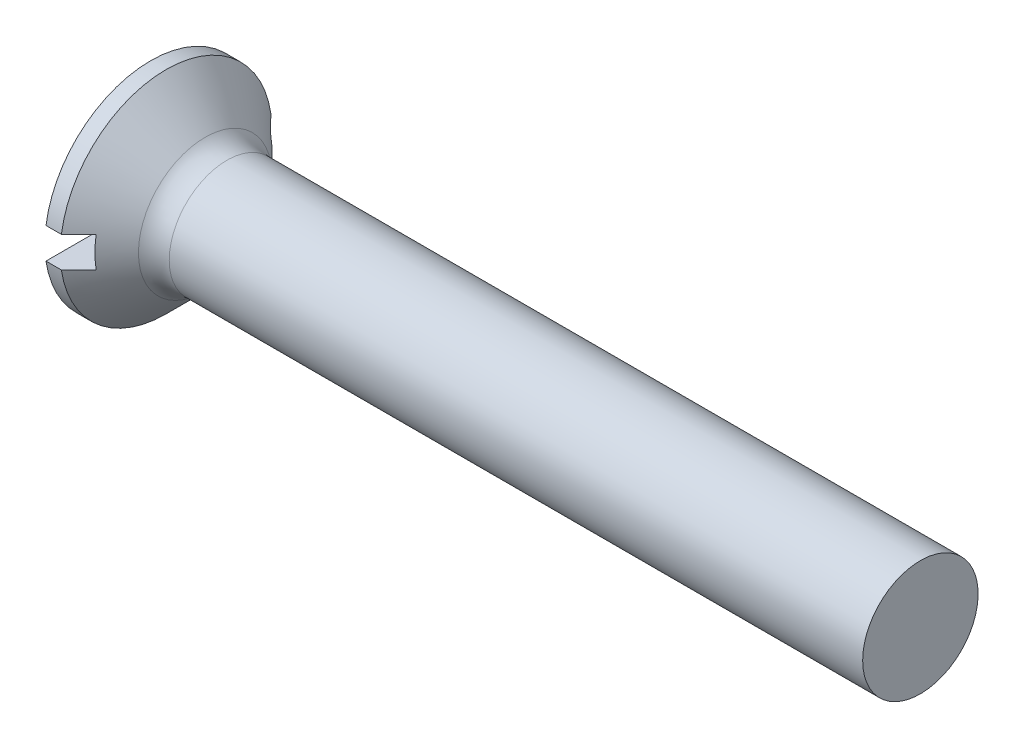
ISO-10303-21;
HEADER;
FILE_DESCRIPTION(('STEP AP214'),'2;1');
FILE_NAME('part.step','',(''),(''),'','','');
FILE_SCHEMA(('AUTOMOTIVE_DESIGN { 1 0 10303 214 1 1 1 1 }'));
ENDSEC;
DATA;
#1=APPLICATION_CONTEXT('core data for automotive mechanical design processes');
#2=APPLICATION_PROTOCOL_DEFINITION('international standard','automotive_design',2000,#1);
#3=PRODUCT_CONTEXT('',#1,'mechanical');
#4=PRODUCT('Part','Part','',(#3));
#5=PRODUCT_RELATED_PRODUCT_CATEGORY('part','',(#4));
#6=PRODUCT_DEFINITION_FORMATION('','',#4);
#7=PRODUCT_DEFINITION_CONTEXT('part definition',#1,'design');
#8=PRODUCT_DEFINITION('design','',#6,#7);
#9=PRODUCT_DEFINITION_SHAPE('','',#8);
#10=(LENGTH_UNIT() NAMED_UNIT(*) SI_UNIT(.MILLI.,.METRE.));
#11=(NAMED_UNIT(*) PLANE_ANGLE_UNIT() SI_UNIT($,.RADIAN.));
#12=(NAMED_UNIT(*) SI_UNIT($,.STERADIAN.) SOLID_ANGLE_UNIT());
#13=UNCERTAINTY_MEASURE_WITH_UNIT(LENGTH_MEASURE(1.E-05),#10,'distance_accuracy_value','');
#14=(GEOMETRIC_REPRESENTATION_CONTEXT(3) GLOBAL_UNCERTAINTY_ASSIGNED_CONTEXT((#13)) GLOBAL_UNIT_ASSIGNED_CONTEXT((#10,
#11,#12)) REPRESENTATION_CONTEXT('',''));
#15=CARTESIAN_POINT('',(0.,0.,0.));
#16=DIRECTION('',(0.,0.,1.));
#17=DIRECTION('',(1.,0.,0.));
#18=AXIS2_PLACEMENT_3D('',#15,#16,#17);
#19=CARTESIAN_POINT('',(0.,0.,0.));
#20=DIRECTION('',(-1.,0.,0.));
#21=DIRECTION('',(0.,0.,1.));
#22=AXIS2_PLACEMENT_3D('',#19,#20,#21);
#23=PLANE('',#22);
#24=DIRECTION('',(0.,0.,-1.));
#25=VECTOR('',#24,1.);
#26=CARTESIAN_POINT('',(0.,0.4,2.75));
#27=LINE('',#26,#25);
#28=CARTESIAN_POINT('',(0.,0.4,2.72075357208256));
#29=VERTEX_POINT('',#28);
#30=CARTESIAN_POINT('',(0.,0.4,-2.72075357208256));
#31=VERTEX_POINT('',#30);
#32=EDGE_CURVE('E178',#29,#31,#27,.T.);
#33=ORIENTED_EDGE('',*,*,#32,.F.);
#34=CARTESIAN_POINT('',(0.,0.,0.));
#35=DIRECTION('',(-1.,0.,0.));
#36=DIRECTION('',(0.,0.,1.));
#37=AXIS2_PLACEMENT_3D('',#34,#35,#36);
#38=CIRCLE('',#37,2.75);
#39=EDGE_CURVE('E143',#29,#31,#38,.T.);
#40=ORIENTED_EDGE('',*,*,#39,.T.);
#41=EDGE_LOOP('',(#33,#40));
#42=FACE_BOUND('',#41,.T.);
#43=ADVANCED_FACE('F35',(#42),#23,.T.);
#44=CARTESIAN_POINT('',(-6.34999999999999,0.,0.));
#45=DIRECTION('',(-1.,0.,0.));
#46=DIRECTION('',(0.,0.,1.));
#47=AXIS2_PLACEMENT_3D('',#44,#45,#46);
#48=CYLINDRICAL_SURFACE('',#47,2.75);
#49=DIRECTION('',(-1.,0.,0.));
#50=VECTOR('',#49,1.);
#51=CARTESIAN_POINT('',(-6.34999999999999,0.4,-2.72075357208256));
#52=LINE('',#51,#50);
#53=CARTESIAN_POINT('',(0.400000000000003,0.4,-2.72075357208256));
#54=VERTEX_POINT('',#53);
#55=EDGE_CURVE('E64',#31,#54,#52,.F.);
#56=ORIENTED_EDGE('',*,*,#55,.F.);
#57=ORIENTED_EDGE('',*,*,#39,.F.);
#58=DIRECTION('',(-1.,0.,0.));
#59=VECTOR('',#58,1.);
#60=CARTESIAN_POINT('',(-6.34999999999999,0.4,2.72075357208256));
#61=LINE('',#60,#59);
#62=CARTESIAN_POINT('',(0.400000000000002,0.4,2.72075357208256));
#63=VERTEX_POINT('',#62);
#64=EDGE_CURVE('E184',#63,#29,#61,.T.);
#65=ORIENTED_EDGE('',*,*,#64,.F.);
#66=CARTESIAN_POINT('',(0.400000000000003,0.,0.));
#67=DIRECTION('',(-1.,0.,0.));
#68=DIRECTION('',(0.,0.,1.));
#69=AXIS2_PLACEMENT_3D('',#66,#67,#68);
#70=CIRCLE('',#69,2.75);
#71=EDGE_CURVE('E113',#63,#54,#70,.T.);
#72=ORIENTED_EDGE('',*,*,#71,.T.);
#73=EDGE_LOOP('',(#56,#57,#65,#72));
#74=FACE_BOUND('',#73,.T.);
#75=ADVANCED_FACE('F165',(#74),#48,.T.);
#76=DIRECTION('',(0.,0.,1.));
#77=VECTOR('',#76,1.);
#78=CARTESIAN_POINT('',(0.,-0.400000000000001,-2.75));
#79=LINE('',#78,#77);
#80=CARTESIAN_POINT('',(0.,-0.400000000000001,-2.72075357208256));
#81=VERTEX_POINT('',#80);
#82=CARTESIAN_POINT('',(0.,-0.400000000000001,2.72075357208256));
#83=VERTEX_POINT('',#82);
#84=EDGE_CURVE('E107',#81,#83,#79,.T.);
#85=ORIENTED_EDGE('',*,*,#84,.F.);
#86=EDGE_CURVE('E133',#81,#83,#38,.T.);
#87=ORIENTED_EDGE('',*,*,#86,.T.);
#88=EDGE_LOOP('',(#85,#87));
#89=FACE_BOUND('',#88,.T.);
#90=ADVANCED_FACE('F163',(#89),#23,.T.);
#91=DIRECTION('',(-1.,0.,0.));
#92=VECTOR('',#91,1.);
#93=CARTESIAN_POINT('',(-6.34999999999999,-0.400000000000001,2.72075357208256));
#94=LINE('',#93,#92);
#95=CARTESIAN_POINT('',(0.400000000000003,-0.400000000000001,2.72075357208256));
#96=VERTEX_POINT('',#95);
#97=EDGE_CURVE('E134',#83,#96,#94,.F.);
#98=ORIENTED_EDGE('',*,*,#97,.F.);
#99=ORIENTED_EDGE('',*,*,#86,.F.);
#100=DIRECTION('',(-1.,0.,0.));
#101=VECTOR('',#100,1.);
#102=CARTESIAN_POINT('',(-6.34999999999999,-0.400000000000001,-2.72075357208256));
#103=LINE('',#102,#101);
#104=CARTESIAN_POINT('',(0.400000000000002,-0.400000000000001,-2.72075357208256));
#105=VERTEX_POINT('',#104);
#106=EDGE_CURVE('E123',#105,#81,#103,.T.);
#107=ORIENTED_EDGE('',*,*,#106,.F.);
#108=EDGE_CURVE('E131',#105,#96,#70,.T.);
#109=ORIENTED_EDGE('',*,*,#108,.T.);
#110=EDGE_LOOP('',(#98,#99,#107,#109));
#111=FACE_BOUND('',#110,.T.);
#112=ADVANCED_FACE('F130',(#111),#48,.T.);
#113=CARTESIAN_POINT('',(0.400000000000003,0.,0.));
#114=DIRECTION('',(-1.,0.,0.));
#115=DIRECTION('',(0.,0.,1.));
#116=AXIS2_PLACEMENT_3D('',#113,#114,#115);
#117=CONICAL_SURFACE('',#116,2.75,0.785398163397449);
#118=CARTESIAN_POINT('',(-2.91122703099808,0.399999999999999,-6.04801398157296));
#119=CARTESIAN_POINT('',(-2.70333669995713,0.399999999999999,-5.83966573752139));
#120=CARTESIAN_POINT('',(-2.49546630031166,0.399999999999999,-5.63129758737052));
#121=CARTESIAN_POINT('',(-2.07978706521848,0.399999999999999,-5.2144912620075));
#122=CARTESIAN_POINT('',(-1.87197823113853,0.399999999999999,-5.00605308543134));
#123=CARTESIAN_POINT('',(-1.45635477241037,0.399999999999999,-4.58898711382912));
#124=CARTESIAN_POINT('',(-1.2485401909839,0.399999999999999,-4.38035927572767));
#125=CARTESIAN_POINT('',(-0.833054486611349,0.399999999999999,-3.96296915720086));
#126=CARTESIAN_POINT('',(-0.625383360847279,0.399999999999999,-3.75420687958157));
#127=CARTESIAN_POINT('',(-0.208177797150705,0.399999999999999,-3.33435396336397));
#128=CARTESIAN_POINT('',(0.00135434759481831,0.4,-3.12326104596609));
#129=CARTESIAN_POINT('',(0.420030451513073,0.4,-2.70066518043499));
#130=CARTESIAN_POINT('',(0.629174386878202,0.4,-2.48916220868137));
#131=CARTESIAN_POINT('',(0.942224156138593,0.4,-2.1713129981671));
#132=CARTESIAN_POINT('',(1.04644766129475,0.4,-2.06527989301767));
#133=CARTESIAN_POINT('',(1.25455725538018,0.4,-1.85287805131423));
#134=CARTESIAN_POINT('',(1.35844333617521,0.4,-1.7465093067891));
#135=CARTESIAN_POINT('',(1.56564763937195,0.4,-1.53324094855307));
#136=CARTESIAN_POINT('',(1.66896592306241,0.4,-1.42634139460757));
#137=CARTESIAN_POINT('',(1.82313895681254,0.4,-1.26522565766366));
#138=CARTESIAN_POINT('',(1.87439491657569,0.4,-1.21139372905201));
#139=CARTESIAN_POINT('',(1.9765104755376,0.4,-1.10335558747567));
#140=CARTESIAN_POINT('',(2.02737008031461,0.4,-1.04914937979886));
#141=CARTESIAN_POINT('',(2.10536761914265,0.4,-0.965078768929768));
#142=CARTESIAN_POINT('',(2.13272119248435,0.4,-0.935414601324456));
#143=CARTESIAN_POINT('',(2.18719151166742,0.4,-0.875868286782248));
#144=CARTESIAN_POINT('',(2.21430825226833,0.4,-0.845986135048678));
#145=CARTESIAN_POINT('',(2.26822565449431,0.4,-0.785940027475329));
#146=CARTESIAN_POINT('',(2.29502633530682,0.4,-0.755776088943664));
#147=CARTESIAN_POINT('',(2.3481868103884,0.4,-0.695065970456105));
#148=CARTESIAN_POINT('',(2.37454662451584,0.4,-0.664519807826037));
#149=CARTESIAN_POINT('',(2.43976155242959,0.4,-0.587422608894617));
#150=CARTESIAN_POINT('',(2.4782379170761,0.4,-0.540543920717877));
#151=CARTESIAN_POINT('',(2.53401321051796,0.4,-0.468681597610835));
#152=CARTESIAN_POINT('',(2.55228877360357,0.4,-0.444459986191997));
#153=CARTESIAN_POINT('',(2.5878711479654,0.4,-0.395319156108841));
#154=CARTESIAN_POINT('',(2.60517823468485,0.4,-0.370400138848684));
#155=CARTESIAN_POINT('',(2.64157672655789,0.4,-0.314684261327314));
#156=CARTESIAN_POINT('',(2.66036306205222,0.4,-0.283684842438351));
#157=CARTESIAN_POINT('',(2.69440764635418,0.4,-0.219761693796644));
#158=CARTESIAN_POINT('',(2.70967206186428,0.4,-0.186841455937734));
#159=CARTESIAN_POINT('',(2.73016014153724,0.4,-0.129375221596079));
#160=CARTESIAN_POINT('',(2.73703138273339,0.4,-0.105439966049049));
#161=CARTESIAN_POINT('',(2.74668434716516,0.4,-0.0567945818244747));
#162=CARTESIAN_POINT('',(2.74948035548682,0.4,-0.0320874714607024));
#163=CARTESIAN_POINT('',(2.75038742305556,0.4,0.0175418217821295));
#164=CARTESIAN_POINT('',(2.74847509810649,0.4,0.0424644630823501));
#165=CARTESIAN_POINT('',(2.74036552241371,0.4,0.0916234589116814));
#166=CARTESIAN_POINT('',(2.73415677384007,0.4,0.115857789823384));
#167=CARTESIAN_POINT('',(2.71827371927204,0.4,0.164097461973523));
#168=CARTESIAN_POINT('',(2.70848082711735,0.4,0.188061916430981));
#169=CARTESIAN_POINT('',(2.68657810309997,0.4,0.234925488056129));
#170=CARTESIAN_POINT('',(2.67446406551726,0.4,0.257822576152257));
#171=CARTESIAN_POINT('',(2.64859519565537,0.4,0.302903050832691));
#172=CARTESIAN_POINT('',(2.63482775852877,0.4,0.325079071971882));
#173=CARTESIAN_POINT('',(2.60624001527761,0.4,0.368705812927867));
#174=CARTESIAN_POINT('',(2.59142061970022,0.4,0.390157136844756));
#175=CARTESIAN_POINT('',(2.54324495089253,0.4,0.457380684412));
#176=CARTESIAN_POINT('',(2.50853115786271,0.4,0.502172551984681));
#177=CARTESIAN_POINT('',(2.4373574689067,0.4,0.59035551998142));
#178=CARTESIAN_POINT('',(2.40089644203553,0.4,0.633745681848959));
#179=CARTESIAN_POINT('',(2.32688330317303,0.4,0.719722652435563));
#180=CARTESIAN_POINT('',(2.28932931399318,0.4,0.762307843089056));
#181=CARTESIAN_POINT('',(2.21358878416378,0.4,0.846885546517383));
#182=CARTESIAN_POINT('',(2.17540243181155,0.4,0.88887822906174));
#183=CARTESIAN_POINT('',(2.06044068334855,0.4,1.01402227230978));
#184=CARTESIAN_POINT('',(1.98303698108055,0.4,1.09659540299884));
#185=CARTESIAN_POINT('',(1.82747335677727,0.4,1.26085212091515));
#186=CARTESIAN_POINT('',(1.74931433457,0.4,1.34253656700301));
#187=CARTESIAN_POINT('',(1.59286602877706,0.4,1.5050408250321));
#188=CARTESIAN_POINT('',(1.51457909296923,0.4,1.58586289734368));
#189=CARTESIAN_POINT('',(1.35769196697885,0.4,1.74720261153538));
#190=CARTESIAN_POINT('',(1.27909177531289,0.4,1.82772025197036));
#191=CARTESIAN_POINT('',(1.04297819662848,0.4,2.0689729085055));
#192=CARTESIAN_POINT('',(0.88515488924209,0.4,2.22940447684663));
#193=CARTESIAN_POINT('',(0.569022750342752,0.4,2.54992542692341));
#194=CARTESIAN_POINT('',(0.410713737476911,0.4,2.71001462943084));
#195=CARTESIAN_POINT('',(0.0938467517062742,0.4,3.02994348223415));
#196=CARTESIAN_POINT('',(-0.0647112188507669,0.4,3.18978313485535));
#197=CARTESIAN_POINT('',(-0.540591127347225,0.4,3.66904928426919));
#198=CARTESIAN_POINT('',(-0.858143098403659,0.400000000000001,3.98824727310347));
#199=CARTESIAN_POINT('',(-1.49349686932321,0.400000000000001,4.62632608508982));
#200=CARTESIAN_POINT('',(-1.81129863870675,0.400000000000001,4.94520693861195));
#201=CARTESIAN_POINT('',(-2.25950055023472,0.400000000000001,5.39470040618392));
#202=CARTESIAN_POINT('',(-2.3898327681651,0.400000000000001,5.52538075051318));
#203=CARTESIAN_POINT('',(-2.65051602794781,0.400000000000001,5.78671502436767));
#204=CARTESIAN_POINT('',(-2.78086706913672,0.400000000000001,5.91736895455465));
#205=CARTESIAN_POINT('',(-2.91122703099808,0.400000000000001,6.04801398157296));
#206=B_SPLINE_CURVE_WITH_KNOTS('',3,(#118,#119,#120,#121,#122,#123,#124,#125,#126,#127,#128,
#129,#130,#131,#132,#133,#134,#135,#136,#137,#138,#139,#140,#141,#142,#143,#144,#145,#146,#147,
#148,#149,#150,#151,#152,#153,#154,#155,#156,#157,#158,#159,#160,#161,#162,#163,#164,#165,#166,
#167,#168,#169,#170,#171,#172,#173,#174,#175,#176,#177,#178,#179,#180,#181,#182,#183,#184,#185,
#186,#187,#188,#189,#190,#191,#192,#193,#194,#195,#196,#197,#198,#199,#200,#201,#202,#203,#204,
#205),.UNSPECIFIED.,.F.,.F.,(4,2,2,2,2,2,2,2,2,2,2,2,2,2,2,2,2,2,2,2,2,2,2,2,2,2,2,2,2,2,2,2,2,
2,2,2,2,2,2,2,2,2,2,4),(0.,0.882975910860476,1.76597015363403,2.64937958225391,3.53277113384024,
4.42505762724969,5.31739714423807,5.76343472500756,6.20948297970986,6.65548210253546,
6.87847301535126,7.10146078413753,7.22251193727136,7.34356576218222,7.46461219989591,
7.58565317043343,7.7675312303056,7.85854400270903,7.94953075732351,8.05816632031485,
8.16661019949531,8.24105170239749,8.31523162951187,8.38978071779309,8.46453008531399,
8.54201686233401,8.61964538973785,8.69790858090398,8.77610483669631,8.94600506687254,
9.11601679556836,9.28634010861834,9.45661358569746,9.79613758747496,10.1352975424543,
10.4728599134666,10.8104238848896,11.4855651220708,12.1610000728678,12.8364286918874,
14.1871833908348,15.5377930820781,16.0914848296691,16.6451603543132),.UNSPECIFIED.);
#207=CARTESIAN_POINT('',(0.85,0.4,-2.26495033058123));
#208=VERTEX_POINT('',#207);
#209=EDGE_CURVE('E11',#54,#208,#206,.T.);
#210=ORIENTED_EDGE('',*,*,#209,.F.);
#211=ORIENTED_EDGE('',*,*,#71,.F.);
#212=CARTESIAN_POINT('',(0.85,0.4,2.26495033058123));
#213=VERTEX_POINT('',#212);
#214=EDGE_CURVE('E39',#213,#63,#206,.T.);
#215=ORIENTED_EDGE('',*,*,#214,.F.);
#216=CARTESIAN_POINT('',(0.85,0.,0.));
#217=DIRECTION('',(-1.,0.,0.));
#218=DIRECTION('',(0.,0.,1.));
#219=AXIS2_PLACEMENT_3D('',#216,#217,#218);
#220=CIRCLE('',#219,2.3);
#221=CARTESIAN_POINT('',(0.85,-0.400000000000001,2.26495033058123));
#222=VERTEX_POINT('',#221);
#223=EDGE_CURVE('E93',#213,#222,#220,.F.);
#224=ORIENTED_EDGE('',*,*,#223,.T.);
#225=CARTESIAN_POINT('',(-2.91122703099808,-0.400000000000001,6.04801398157295));
#226=CARTESIAN_POINT('',(-2.70333669995713,-0.400000000000001,5.83966573752139));
#227=CARTESIAN_POINT('',(-2.49546630031166,-0.400000000000001,5.63129758737052));
#228=CARTESIAN_POINT('',(-2.07978706521848,-0.400000000000001,5.2144912620075));
#229=CARTESIAN_POINT('',(-1.87197823113852,-0.400000000000001,5.00605308543134));
#230=CARTESIAN_POINT('',(-1.45635477241037,-0.400000000000001,4.58898711382912));
#231=CARTESIAN_POINT('',(-1.2485401909839,-0.400000000000001,4.38035927572767));
#232=CARTESIAN_POINT('',(-0.833054486611348,-0.400000000000001,3.96296915720086));
#233=CARTESIAN_POINT('',(-0.625383360847278,-0.400000000000001,3.75420687958157));
#234=CARTESIAN_POINT('',(-0.208177797150704,-0.400000000000001,3.33435396336397));
#235=CARTESIAN_POINT('',(0.0013543475948197,-0.400000000000001,3.12326104596608));
#236=CARTESIAN_POINT('',(0.420030451513074,-0.400000000000001,2.70066518043499));
#237=CARTESIAN_POINT('',(0.629174386878203,-0.400000000000001,2.48916220868137));
#238=CARTESIAN_POINT('',(0.942224156138594,-0.400000000000001,2.17131299816709));
#239=CARTESIAN_POINT('',(1.04644766129475,-0.400000000000001,2.06527989301766));
#240=CARTESIAN_POINT('',(1.25455725538018,-0.400000000000001,1.85287805131423));
#241=CARTESIAN_POINT('',(1.35844333617521,-0.400000000000001,1.7465093067891));
#242=CARTESIAN_POINT('',(1.56564763937195,-0.400000000000001,1.53324094855307));
#243=CARTESIAN_POINT('',(1.66896592306241,-0.400000000000001,1.42634139460757));
#244=CARTESIAN_POINT('',(1.82313895681254,-0.400000000000001,1.26522565766366));
#245=CARTESIAN_POINT('',(1.87439491657569,-0.400000000000001,1.21139372905201));
#246=CARTESIAN_POINT('',(1.9765104755376,-0.400000000000001,1.10335558747567));
#247=CARTESIAN_POINT('',(2.02737008031461,-0.400000000000001,1.04914937979886));
#248=CARTESIAN_POINT('',(2.10536761914265,-0.400000000000001,0.965078768929768));
#249=CARTESIAN_POINT('',(2.13272119248435,-0.400000000000001,0.935414601324456));
#250=CARTESIAN_POINT('',(2.18719151166742,-0.400000000000001,0.875868286782247));
#251=CARTESIAN_POINT('',(2.21430825226833,-0.400000000000001,0.845986135048677));
#252=CARTESIAN_POINT('',(2.26822565449431,-0.400000000000001,0.785940027475329));
#253=CARTESIAN_POINT('',(2.29502633530682,-0.400000000000001,0.755776088943663));
#254=CARTESIAN_POINT('',(2.3481868103884,-0.400000000000001,0.695065970456104));
#255=CARTESIAN_POINT('',(2.37454662451584,-0.400000000000001,0.664519807826037));
#256=CARTESIAN_POINT('',(2.43976155242959,-0.400000000000001,0.587422608894616));
#257=CARTESIAN_POINT('',(2.4782379170761,-0.400000000000001,0.540543920717876));
#258=CARTESIAN_POINT('',(2.53401321051796,-0.400000000000001,0.468681597610834));
#259=CARTESIAN_POINT('',(2.55228877360357,-0.400000000000001,0.444459986191996));
#260=CARTESIAN_POINT('',(2.5878711479654,-0.400000000000001,0.39531915610884));
#261=CARTESIAN_POINT('',(2.60517823468484,-0.400000000000001,0.370400138848683));
#262=CARTESIAN_POINT('',(2.64157672655789,-0.400000000000001,0.314684261327312));
#263=CARTESIAN_POINT('',(2.66036306205222,-0.400000000000001,0.28368484243835));
#264=CARTESIAN_POINT('',(2.69440764635418,-0.400000000000001,0.219761693796643));
#265=CARTESIAN_POINT('',(2.70967206186428,-0.400000000000001,0.186841455937734));
#266=CARTESIAN_POINT('',(2.73016014153724,-0.400000000000001,0.129375221596078));
#267=CARTESIAN_POINT('',(2.73703138273339,-0.400000000000001,0.105439966049049));
#268=CARTESIAN_POINT('',(2.74668434716516,-0.400000000000001,0.056794581824474));
#269=CARTESIAN_POINT('',(2.74948035548682,-0.400000000000001,0.0320874714607017));
#270=CARTESIAN_POINT('',(2.75038742305556,-0.400000000000001,-0.0175418217821303));
#271=CARTESIAN_POINT('',(2.74847509810649,-0.400000000000001,-0.0424644630823509));
#272=CARTESIAN_POINT('',(2.74036552241371,-0.400000000000001,-0.0916234589116823));
#273=CARTESIAN_POINT('',(2.73415677384007,-0.400000000000001,-0.115857789823385));
#274=CARTESIAN_POINT('',(2.71827371927204,-0.400000000000001,-0.164097461973524));
#275=CARTESIAN_POINT('',(2.70848082711735,-0.400000000000001,-0.188061916430982));
#276=CARTESIAN_POINT('',(2.68657810309996,-0.400000000000001,-0.234925488056131));
#277=CARTESIAN_POINT('',(2.67446406551726,-0.400000000000001,-0.25782257615226));
#278=CARTESIAN_POINT('',(2.64859519565537,-0.400000000000001,-0.302903050832693));
#279=CARTESIAN_POINT('',(2.63482775852877,-0.400000000000001,-0.325079071971884));
#280=CARTESIAN_POINT('',(2.60624001527761,-0.400000000000001,-0.368705812927868));
#281=CARTESIAN_POINT('',(2.59142061970022,-0.400000000000001,-0.390157136844758));
#282=CARTESIAN_POINT('',(2.54324495089253,-0.400000000000001,-0.457380684412003));
#283=CARTESIAN_POINT('',(2.50853115786271,-0.400000000000001,-0.502172551984684));
#284=CARTESIAN_POINT('',(2.4373574689067,-0.400000000000001,-0.590355519981424));
#285=CARTESIAN_POINT('',(2.40089644203552,-0.400000000000001,-0.633745681848964));
#286=CARTESIAN_POINT('',(2.32688330317302,-0.400000000000001,-0.719722652435568));
#287=CARTESIAN_POINT('',(2.28932931399317,-0.400000000000001,-0.762307843089062));
#288=CARTESIAN_POINT('',(2.21358878416378,-0.400000000000001,-0.846885546517389));
#289=CARTESIAN_POINT('',(2.17540243181154,-0.400000000000001,-0.888878229061746));
#290=CARTESIAN_POINT('',(2.06044068334854,-0.400000000000001,-1.01402227230978));
#291=CARTESIAN_POINT('',(1.98303698108055,-0.400000000000001,-1.09659540299884));
#292=CARTESIAN_POINT('',(1.82747335677727,-0.400000000000001,-1.26085212091516));
#293=CARTESIAN_POINT('',(1.74931433456999,-0.400000000000001,-1.34253656700302));
#294=CARTESIAN_POINT('',(1.59286602877705,-0.400000000000001,-1.50504082503211));
#295=CARTESIAN_POINT('',(1.51457909296922,-0.400000000000001,-1.58586289734369));
#296=CARTESIAN_POINT('',(1.35769196697884,-0.400000000000001,-1.74720261153539));
#297=CARTESIAN_POINT('',(1.27909177531288,-0.400000000000001,-1.82772025197038));
#298=CARTESIAN_POINT('',(1.04297819662847,-0.400000000000001,-2.06897290850551));
#299=CARTESIAN_POINT('',(0.885154889242074,-0.400000000000001,-2.22940447684664));
#300=CARTESIAN_POINT('',(0.569022750342733,-0.400000000000001,-2.54992542692343));
#301=CARTESIAN_POINT('',(0.410713737476892,-0.400000000000001,-2.71001462943086));
#302=CARTESIAN_POINT('',(0.0938467517062523,-0.400000000000001,-3.02994348223417));
#303=CARTESIAN_POINT('',(-0.0647112188507896,-0.400000000000001,-3.18978313485537));
#304=CARTESIAN_POINT('',(-0.540591127347252,-0.400000000000001,-3.66904928426922));
#305=CARTESIAN_POINT('',(-0.858143098403687,-0.400000000000001,-3.98824727310349));
#306=CARTESIAN_POINT('',(-1.49349686932325,-0.400000000000001,-4.62632608508985));
#307=CARTESIAN_POINT('',(-1.81129863870679,-0.400000000000001,-4.94520693861199));
#308=CARTESIAN_POINT('',(-2.25950055023475,-0.400000000000001,-5.39470040618395));
#309=CARTESIAN_POINT('',(-2.38983276816513,-0.400000000000001,-5.5253807505132));
#310=CARTESIAN_POINT('',(-2.65051602794782,-0.400000000000001,-5.78671502436768));
#311=CARTESIAN_POINT('',(-2.78086706913673,-0.400000000000001,-5.91736895455466));
#312=CARTESIAN_POINT('',(-2.91122703099808,-0.400000000000001,-6.04801398157295));
#313=B_SPLINE_CURVE_WITH_KNOTS('',3,(#225,#226,#227,#228,#229,#230,#231,#232,#233,#234,#235,
#236,#237,#238,#239,#240,#241,#242,#243,#244,#245,#246,#247,#248,#249,#250,#251,#252,#253,#254,
#255,#256,#257,#258,#259,#260,#261,#262,#263,#264,#265,#266,#267,#268,#269,#270,#271,#272,#273,
#274,#275,#276,#277,#278,#279,#280,#281,#282,#283,#284,#285,#286,#287,#288,#289,#290,#291,#292,
#293,#294,#295,#296,#297,#298,#299,#300,#301,#302,#303,#304,#305,#306,#307,#308,#309,#310,#311,
#312),.UNSPECIFIED.,.F.,.F.,(4,2,2,2,2,2,2,2,2,2,2,2,2,2,2,2,2,2,2,2,2,2,2,2,2,2,2,2,2,2,2,2,2,
2,2,2,2,2,2,2,2,2,2,4),(0.,0.882975910860476,1.76597015363403,2.6493795822539,3.53277113384024,
4.42505762724969,5.31739714423807,5.76343472500756,6.20948297970986,6.65548210253546,
6.87847301535126,7.10146078413753,7.22251193727136,7.34356576218222,7.4646121998959,
7.58565317043343,7.7675312303056,7.85854400270903,7.94953075732351,8.05816632031485,
8.16661019949531,8.24105170239749,8.31523162951187,8.38978071779309,8.46453008531399,
8.542016862334,8.61964538973785,8.69790858090398,8.77610483669631,8.94600506687254,
9.11601679556836,9.28634010861835,9.45661358569747,9.79613758747497,10.1352975424543,
10.4728599134667,10.8104238848897,11.4855651220709,12.1610000728679,12.8364286918874,
14.1871833908349,15.5377930820782,16.0914848296691,16.6451603543132),.UNSPECIFIED.);
#314=EDGE_CURVE('E101',#96,#222,#313,.T.);
#315=ORIENTED_EDGE('',*,*,#314,.F.);
#316=ORIENTED_EDGE('',*,*,#108,.F.);
#317=CARTESIAN_POINT('',(0.85,-0.400000000000001,-2.26495033058123));
#318=VERTEX_POINT('',#317);
#319=EDGE_CURVE('E50',#318,#105,#313,.T.);
#320=ORIENTED_EDGE('',*,*,#319,.F.);
#321=EDGE_CURVE('E104',#318,#208,#220,.F.);
#322=ORIENTED_EDGE('',*,*,#321,.T.);
#323=EDGE_LOOP('',(#210,#211,#215,#224,#315,#316,#320,#322));
#324=FACE_BOUND('',#323,.T.);
#325=CARTESIAN_POINT('',(1.41568542494924,0.,0.));
#326=DIRECTION('',(-1.,0.,0.));
#327=DIRECTION('',(0.,0.,1.));
#328=AXIS2_PLACEMENT_3D('',#325,#326,#327);
#329=CIRCLE('',#328,1.73431457505076);
#330=CARTESIAN_POINT('',(1.41568542494924,0.,1.73431457505076));
#331=VERTEX_POINT('',#330);
#332=EDGE_CURVE('E144',#331,#331,#329,.T.);
#333=ORIENTED_EDGE('',*,*,#332,.T.);
#334=EDGE_LOOP('',(#333));
#335=FACE_BOUND('',#334,.T.);
#336=ADVANCED_FACE('F110',(#324,#335),#117,.T.);
#337=CARTESIAN_POINT('',(-6.34999999999999,0.,0.));
#338=DIRECTION('',(-1.,0.,0.));
#339=DIRECTION('',(0.,0.,1.));
#340=AXIS2_PLACEMENT_3D('',#337,#338,#339);
#341=CYLINDRICAL_SURFACE('',#340,1.5);
#342=CARTESIAN_POINT('',(1.98137084989848,0.,0.));
#343=DIRECTION('',(-1.,0.,0.));
#344=DIRECTION('',(0.,0.,1.));
#345=AXIS2_PLACEMENT_3D('',#342,#343,#344);
#346=CIRCLE('',#345,1.5);
#347=CARTESIAN_POINT('',(1.98137084989848,0.,1.5));
#348=VERTEX_POINT('',#347);
#349=EDGE_CURVE('E102',#348,#348,#346,.F.);
#350=ORIENTED_EDGE('',*,*,#349,.T.);
#351=EDGE_LOOP('',(#350));
#352=FACE_BOUND('',#351,.T.);
#353=CARTESIAN_POINT('',(20.,0.,0.));
#354=DIRECTION('',(-1.,0.,0.));
#355=DIRECTION('',(0.,0.,1.));
#356=AXIS2_PLACEMENT_3D('',#353,#354,#355);
#357=CIRCLE('',#356,1.5);
#358=CARTESIAN_POINT('',(20.,0.,1.5));
#359=VERTEX_POINT('',#358);
#360=EDGE_CURVE('E136',#359,#359,#357,.T.);
#361=ORIENTED_EDGE('',*,*,#360,.T.);
#362=EDGE_LOOP('',(#361));
#363=FACE_BOUND('',#362,.T.);
#364=ADVANCED_FACE('F150',(#352,#363),#341,.T.);
#365=CARTESIAN_POINT('',(20.,1.5,0.));
#366=DIRECTION('',(1.,0.,0.));
#367=DIRECTION('',(0.,0.,-1.));
#368=AXIS2_PLACEMENT_3D('',#365,#366,#367);
#369=PLANE('',#368);
#370=ORIENTED_EDGE('',*,*,#360,.F.);
#371=EDGE_LOOP('',(#370));
#372=FACE_BOUND('',#371,.T.);
#373=ADVANCED_FACE('F155',(#372),#369,.T.);
#374=CARTESIAN_POINT('',(1.98137084989848,0.,0.));
#375=DIRECTION('',(-1.,0.,0.));
#376=DIRECTION('',(0.,0.,1.));
#377=AXIS2_PLACEMENT_3D('',#374,#375,#376);
#378=TOROIDAL_SURFACE('',#377,2.3,0.8);
#379=ORIENTED_EDGE('',*,*,#349,.F.);
#380=EDGE_LOOP('',(#379));
#381=FACE_BOUND('',#380,.T.);
#382=ORIENTED_EDGE('',*,*,#332,.F.);
#383=EDGE_LOOP('',(#382));
#384=FACE_BOUND('',#383,.T.);
#385=ADVANCED_FACE('F37',(#381,#384),#378,.F.);
#386=CARTESIAN_POINT('',(0.85,0.4,2.75));
#387=DIRECTION('',(0.,1.,0.));
#388=DIRECTION('',(0.,0.,1.));
#389=AXIS2_PLACEMENT_3D('',#386,#387,#388);
#390=PLANE('',#389);
#391=ORIENTED_EDGE('',*,*,#55,.T.);
#392=ORIENTED_EDGE('',*,*,#209,.T.);
#393=DIRECTION('',(0.,0.,-1.));
#394=VECTOR('',#393,1.);
#395=CARTESIAN_POINT('',(0.85,0.4,2.75));
#396=LINE('',#395,#394);
#397=EDGE_CURVE('E96',#213,#208,#396,.T.);
#398=ORIENTED_EDGE('',*,*,#397,.F.);
#399=ORIENTED_EDGE('',*,*,#214,.T.);
#400=ORIENTED_EDGE('',*,*,#64,.T.);
#401=ORIENTED_EDGE('',*,*,#32,.T.);
#402=EDGE_LOOP('',(#391,#392,#398,#399,#400,#401));
#403=FACE_BOUND('',#402,.T.);
#404=ADVANCED_FACE('F105',(#403),#390,.F.);
#405=CARTESIAN_POINT('',(0.85,-0.400000000000001,-2.75));
#406=DIRECTION('',(0.,-1.,0.));
#407=DIRECTION('',(0.,0.,-1.));
#408=AXIS2_PLACEMENT_3D('',#405,#406,#407);
#409=PLANE('',#408);
#410=ORIENTED_EDGE('',*,*,#97,.T.);
#411=ORIENTED_EDGE('',*,*,#314,.T.);
#412=DIRECTION('',(0.,0.,1.));
#413=VECTOR('',#412,1.);
#414=CARTESIAN_POINT('',(0.85,-0.400000000000001,-2.75));
#415=LINE('',#414,#413);
#416=EDGE_CURVE('E57',#318,#222,#415,.T.);
#417=ORIENTED_EDGE('',*,*,#416,.F.);
#418=ORIENTED_EDGE('',*,*,#319,.T.);
#419=ORIENTED_EDGE('',*,*,#106,.T.);
#420=ORIENTED_EDGE('',*,*,#84,.T.);
#421=EDGE_LOOP('',(#410,#411,#417,#418,#419,#420));
#422=FACE_BOUND('',#421,.T.);
#423=ADVANCED_FACE('F122',(#422),#409,.F.);
#424=CARTESIAN_POINT('',(0.85,0.4,-2.75));
#425=DIRECTION('',(-1.,0.,0.));
#426=DIRECTION('',(0.,0.,1.));
#427=AXIS2_PLACEMENT_3D('',#424,#425,#426);
#428=PLANE('',#427);
#429=ORIENTED_EDGE('',*,*,#416,.T.);
#430=ORIENTED_EDGE('',*,*,#223,.F.);
#431=ORIENTED_EDGE('',*,*,#397,.T.);
#432=ORIENTED_EDGE('',*,*,#321,.F.);
#433=EDGE_LOOP('',(#429,#430,#431,#432));
#434=FACE_BOUND('',#433,.T.);
#435=ADVANCED_FACE('F95',(#434),#428,.T.);
#436=CLOSED_SHELL('',(#43,#75,#90,#112,#336,#364,#373,#385,#404,#423,#435));
#437=MANIFOLD_SOLID_BREP('B2',#436);
#438=ADVANCED_BREP_SHAPE_REPRESENTATION('',(#18,#437),#14);
#439=SHAPE_DEFINITION_REPRESENTATION(#9,#438);
ENDSEC;
END-ISO-10303-21;
